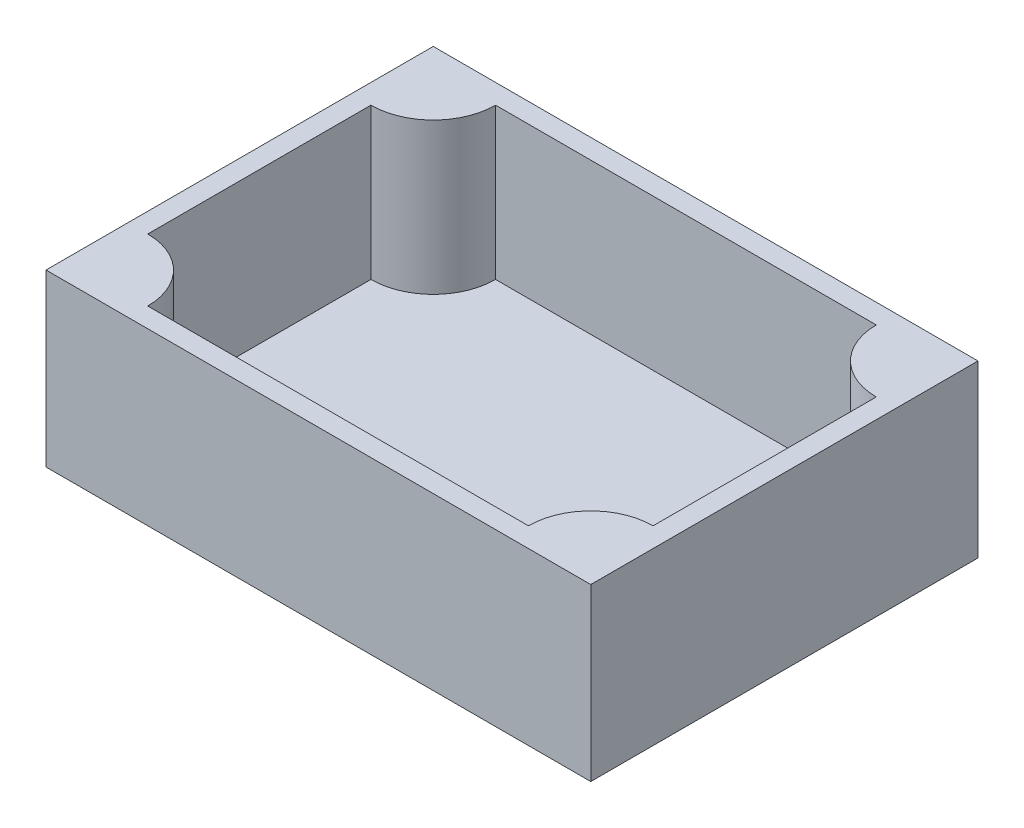
ISO-10303-21;
HEADER;
FILE_DESCRIPTION(('STEP AP214'),'2;1');
FILE_NAME('part.step','',(''),(''),'','','');
FILE_SCHEMA(('AUTOMOTIVE_DESIGN { 1 0 10303 214 1 1 1 1 }'));
ENDSEC;
DATA;
#1=APPLICATION_CONTEXT('core data for automotive mechanical design processes');
#2=APPLICATION_PROTOCOL_DEFINITION('international standard','automotive_design',2000,#1);
#3=PRODUCT_CONTEXT('',#1,'mechanical');
#4=PRODUCT('Part','Part','',(#3));
#5=PRODUCT_RELATED_PRODUCT_CATEGORY('part','',(#4));
#6=PRODUCT_DEFINITION_FORMATION('','',#4);
#7=PRODUCT_DEFINITION_CONTEXT('part definition',#1,'design');
#8=PRODUCT_DEFINITION('design','',#6,#7);
#9=PRODUCT_DEFINITION_SHAPE('','',#8);
#10=(LENGTH_UNIT() NAMED_UNIT(*) SI_UNIT(.MILLI.,.METRE.));
#11=(NAMED_UNIT(*) PLANE_ANGLE_UNIT() SI_UNIT($,.RADIAN.));
#12=(NAMED_UNIT(*) SI_UNIT($,.STERADIAN.) SOLID_ANGLE_UNIT());
#13=UNCERTAINTY_MEASURE_WITH_UNIT(LENGTH_MEASURE(1.E-05),#10,'distance_accuracy_value','');
#14=(GEOMETRIC_REPRESENTATION_CONTEXT(3) GLOBAL_UNCERTAINTY_ASSIGNED_CONTEXT((#13)) GLOBAL_UNIT_ASSIGNED_CONTEXT((#10,
#11,#12)) REPRESENTATION_CONTEXT('',''));
#15=CARTESIAN_POINT('',(0.,0.,0.));
#16=DIRECTION('',(0.,0.,1.));
#17=DIRECTION('',(1.,0.,0.));
#18=AXIS2_PLACEMENT_3D('',#15,#16,#17);
#19=CARTESIAN_POINT('',(0.,3.,0.));
#20=DIRECTION('',(1.,0.,0.));
#21=DIRECTION('',(0.,0.,-1.));
#22=AXIS2_PLACEMENT_3D('',#19,#20,#21);
#23=PLANE('',#22);
#24=DIRECTION('',(0.,0.,1.));
#25=VECTOR('',#24,1.);
#26=CARTESIAN_POINT('',(0.,0.,0.));
#27=LINE('',#26,#25);
#28=CARTESIAN_POINT('',(0.,0.,-59.));
#29=VERTEX_POINT('',#28);
#30=CARTESIAN_POINT('',(0.,0.,0.));
#31=VERTEX_POINT('',#30);
#32=EDGE_CURVE('E159',#29,#31,#27,.T.);
#33=ORIENTED_EDGE('',*,*,#32,.T.);
#34=DIRECTION('',(0.,-1.,0.));
#35=VECTOR('',#34,1.);
#36=CARTESIAN_POINT('',(0.,3.,0.));
#37=LINE('',#36,#35);
#38=CARTESIAN_POINT('',(0.,26.,0.));
#39=VERTEX_POINT('',#38);
#40=EDGE_CURVE('E12',#39,#31,#37,.T.);
#41=ORIENTED_EDGE('',*,*,#40,.F.);
#42=DIRECTION('',(0.,0.,-1.));
#43=VECTOR('',#42,1.);
#44=CARTESIAN_POINT('',(0.,26.,0.));
#45=LINE('',#44,#43);
#46=CARTESIAN_POINT('',(0.,26.,-59.));
#47=VERTEX_POINT('',#46);
#48=EDGE_CURVE('E147',#39,#47,#45,.T.);
#49=ORIENTED_EDGE('',*,*,#48,.T.);
#50=DIRECTION('',(0.,-1.,0.));
#51=VECTOR('',#50,1.);
#52=CARTESIAN_POINT('',(0.,3.,-59.));
#53=LINE('',#52,#51);
#54=EDGE_CURVE('E134',#47,#29,#53,.T.);
#55=ORIENTED_EDGE('',*,*,#54,.T.);
#56=EDGE_LOOP('',(#33,#41,#49,#55));
#57=FACE_BOUND('',#56,.T.);
#58=ADVANCED_FACE('F37',(#57),#23,.F.);
#59=CARTESIAN_POINT('',(0.,3.,0.));
#60=DIRECTION('',(0.,0.,-1.));
#61=DIRECTION('',(-1.,0.,0.));
#62=AXIS2_PLACEMENT_3D('',#59,#60,#61);
#63=PLANE('',#62);
#64=DIRECTION('',(1.,0.,0.));
#65=VECTOR('',#64,1.);
#66=CARTESIAN_POINT('',(0.,0.,0.));
#67=LINE('',#66,#65);
#68=CARTESIAN_POINT('',(83.,0.,0.));
#69=VERTEX_POINT('',#68);
#70=EDGE_CURVE('E172',#31,#69,#67,.T.);
#71=ORIENTED_EDGE('',*,*,#70,.T.);
#72=DIRECTION('',(0.,-1.,0.));
#73=VECTOR('',#72,1.);
#74=CARTESIAN_POINT('',(83.,3.,0.));
#75=LINE('',#74,#73);
#76=CARTESIAN_POINT('',(83.,26.,0.));
#77=VERTEX_POINT('',#76);
#78=EDGE_CURVE('E44',#77,#69,#75,.T.);
#79=ORIENTED_EDGE('',*,*,#78,.F.);
#80=DIRECTION('',(-1.,0.,0.));
#81=VECTOR('',#80,1.);
#82=CARTESIAN_POINT('',(83.,26.,0.));
#83=LINE('',#82,#81);
#84=EDGE_CURVE('E144',#77,#39,#83,.T.);
#85=ORIENTED_EDGE('',*,*,#84,.T.);
#86=ORIENTED_EDGE('',*,*,#40,.T.);
#87=EDGE_LOOP('',(#71,#79,#85,#86));
#88=FACE_BOUND('',#87,.T.);
#89=ADVANCED_FACE('F181',(#88),#63,.F.);
#90=CARTESIAN_POINT('',(83.,3.,0.));
#91=DIRECTION('',(-1.,0.,0.));
#92=DIRECTION('',(0.,0.,1.));
#93=AXIS2_PLACEMENT_3D('',#90,#91,#92);
#94=PLANE('',#93);
#95=DIRECTION('',(0.,0.,-1.));
#96=VECTOR('',#95,1.);
#97=CARTESIAN_POINT('',(83.,0.,0.));
#98=LINE('',#97,#96);
#99=CARTESIAN_POINT('',(83.,0.,-59.));
#100=VERTEX_POINT('',#99);
#101=EDGE_CURVE('E132',#69,#100,#98,.T.);
#102=ORIENTED_EDGE('',*,*,#101,.T.);
#103=DIRECTION('',(0.,-1.,0.));
#104=VECTOR('',#103,1.);
#105=CARTESIAN_POINT('',(83.,3.,-59.));
#106=LINE('',#105,#104);
#107=CARTESIAN_POINT('',(83.,26.,-59.));
#108=VERTEX_POINT('',#107);
#109=EDGE_CURVE('E126',#108,#100,#106,.T.);
#110=ORIENTED_EDGE('',*,*,#109,.F.);
#111=DIRECTION('',(0.,0.,1.));
#112=VECTOR('',#111,1.);
#113=CARTESIAN_POINT('',(83.,26.,0.));
#114=LINE('',#113,#112);
#115=EDGE_CURVE('E130',#108,#77,#114,.T.);
#116=ORIENTED_EDGE('',*,*,#115,.T.);
#117=ORIENTED_EDGE('',*,*,#78,.T.);
#118=EDGE_LOOP('',(#102,#110,#116,#117));
#119=FACE_BOUND('',#118,.T.);
#120=ADVANCED_FACE('F128',(#119),#94,.F.);
#121=CARTESIAN_POINT('',(0.,3.,-59.));
#122=DIRECTION('',(0.,0.,1.));
#123=DIRECTION('',(1.,0.,0.));
#124=AXIS2_PLACEMENT_3D('',#121,#122,#123);
#125=PLANE('',#124);
#126=DIRECTION('',(-1.,0.,0.));
#127=VECTOR('',#126,1.);
#128=CARTESIAN_POINT('',(0.,0.,-59.));
#129=LINE('',#128,#127);
#130=EDGE_CURVE('E59',#100,#29,#129,.T.);
#131=ORIENTED_EDGE('',*,*,#130,.T.);
#132=ORIENTED_EDGE('',*,*,#54,.F.);
#133=DIRECTION('',(1.,0.,0.));
#134=VECTOR('',#133,1.);
#135=CARTESIAN_POINT('',(83.,26.,-59.));
#136=LINE('',#135,#134);
#137=EDGE_CURVE('E141',#47,#108,#136,.T.);
#138=ORIENTED_EDGE('',*,*,#137,.T.);
#139=ORIENTED_EDGE('',*,*,#109,.T.);
#140=EDGE_LOOP('',(#131,#132,#138,#139));
#141=FACE_BOUND('',#140,.T.);
#142=ADVANCED_FACE('F146',(#141),#125,.F.);
#143=CARTESIAN_POINT('',(0.,0.,0.));
#144=DIRECTION('',(0.,-1.,0.));
#145=DIRECTION('',(0.,0.,-1.));
#146=AXIS2_PLACEMENT_3D('',#143,#144,#145);
#147=PLANE('',#146);
#148=ORIENTED_EDGE('',*,*,#32,.F.);
#149=ORIENTED_EDGE('',*,*,#130,.F.);
#150=ORIENTED_EDGE('',*,*,#101,.F.);
#151=ORIENTED_EDGE('',*,*,#70,.F.);
#152=EDGE_LOOP('',(#148,#149,#150,#151));
#153=FACE_BOUND('',#152,.T.);
#154=ADVANCED_FACE('F179',(#153),#147,.T.);
#155=CARTESIAN_POINT('',(3.00000000000001,153.833196944808,-3.));
#156=DIRECTION('',(0.,-1.,0.));
#157=DIRECTION('',(0.,0.,-1.));
#158=AXIS2_PLACEMENT_3D('',#155,#156,#157);
#159=CYLINDRICAL_SURFACE('',#158,9.49999999999998);
#160=CARTESIAN_POINT('',(3.00000000000001,26.,-3.));
#161=DIRECTION('',(0.,-1.,0.));
#162=DIRECTION('',(0.,0.,-1.));
#163=AXIS2_PLACEMENT_3D('',#160,#161,#162);
#164=CIRCLE('',#163,9.49999999999998);
#165=CARTESIAN_POINT('',(12.5,26.,-3.));
#166=VERTEX_POINT('',#165);
#167=CARTESIAN_POINT('',(3.00000000000001,26.,-12.5));
#168=VERTEX_POINT('',#167);
#169=EDGE_CURVE('E153',#166,#168,#164,.F.);
#170=ORIENTED_EDGE('',*,*,#169,.F.);
#171=DIRECTION('',(0.,-1.,0.));
#172=VECTOR('',#171,1.);
#173=CARTESIAN_POINT('',(12.5,153.833196944808,-3.));
#174=LINE('',#173,#172);
#175=CARTESIAN_POINT('',(12.5,3.,-3.));
#176=VERTEX_POINT('',#175);
#177=EDGE_CURVE('E149',#166,#176,#174,.T.);
#178=ORIENTED_EDGE('',*,*,#177,.T.);
#179=CARTESIAN_POINT('',(3.00000000000001,3.,-3.));
#180=DIRECTION('',(0.,-1.,0.));
#181=DIRECTION('',(0.,0.,-1.));
#182=AXIS2_PLACEMENT_3D('',#179,#180,#181);
#183=CIRCLE('',#182,9.49999999999998);
#184=CARTESIAN_POINT('',(3.00000000000001,3.,-12.5));
#185=VERTEX_POINT('',#184);
#186=EDGE_CURVE('E51',#185,#176,#183,.T.);
#187=ORIENTED_EDGE('',*,*,#186,.F.);
#188=DIRECTION('',(0.,-1.,0.));
#189=VECTOR('',#188,1.);
#190=CARTESIAN_POINT('',(3.00000000000001,153.833196944808,-12.5));
#191=LINE('',#190,#189);
#192=EDGE_CURVE('E156',#168,#185,#191,.T.);
#193=ORIENTED_EDGE('',*,*,#192,.F.);
#194=EDGE_LOOP('',(#170,#178,#187,#193));
#195=FACE_BOUND('',#194,.T.);
#196=ADVANCED_FACE('F228',(#195),#159,.T.);
#197=CARTESIAN_POINT('',(12.5,153.833196944808,-3.));
#198=DIRECTION('',(0.,0.,-1.));
#199=DIRECTION('',(-1.,0.,0.));
#200=AXIS2_PLACEMENT_3D('',#197,#198,#199);
#201=PLANE('',#200);
#202=DIRECTION('',(-1.,0.,0.));
#203=VECTOR('',#202,1.);
#204=CARTESIAN_POINT('',(12.5,26.,-3.));
#205=LINE('',#204,#203);
#206=CARTESIAN_POINT('',(70.5,26.,-3.));
#207=VERTEX_POINT('',#206);
#208=EDGE_CURVE('E157',#207,#166,#205,.T.);
#209=ORIENTED_EDGE('',*,*,#208,.F.);
#210=DIRECTION('',(0.,-1.,0.));
#211=VECTOR('',#210,1.);
#212=CARTESIAN_POINT('',(70.5,153.833196944808,-3.));
#213=LINE('',#212,#211);
#214=CARTESIAN_POINT('',(70.5,3.,-3.));
#215=VERTEX_POINT('',#214);
#216=EDGE_CURVE('E198',#207,#215,#213,.T.);
#217=ORIENTED_EDGE('',*,*,#216,.T.);
#218=DIRECTION('',(1.,0.,0.));
#219=VECTOR('',#218,1.);
#220=CARTESIAN_POINT('',(12.5,3.,-3.));
#221=LINE('',#220,#219);
#222=EDGE_CURVE('E203',#176,#215,#221,.T.);
#223=ORIENTED_EDGE('',*,*,#222,.F.);
#224=ORIENTED_EDGE('',*,*,#177,.F.);
#225=EDGE_LOOP('',(#209,#217,#223,#224));
#226=FACE_BOUND('',#225,.T.);
#227=ADVANCED_FACE('F234',(#226),#201,.T.);
#228=CARTESIAN_POINT('',(80.,153.833196944808,-3.00000000000001));
#229=DIRECTION('',(0.,-1.,0.));
#230=DIRECTION('',(0.,0.,-1.));
#231=AXIS2_PLACEMENT_3D('',#228,#229,#230);
#232=CYLINDRICAL_SURFACE('',#231,9.49999999999997);
#233=CARTESIAN_POINT('',(80.,26.,-3.00000000000001));
#234=DIRECTION('',(0.,-1.,0.));
#235=DIRECTION('',(0.,0.,-1.));
#236=AXIS2_PLACEMENT_3D('',#233,#234,#235);
#237=CIRCLE('',#236,9.49999999999997);
#238=CARTESIAN_POINT('',(80.,26.,-12.5));
#239=VERTEX_POINT('',#238);
#240=EDGE_CURVE('E160',#239,#207,#237,.F.);
#241=ORIENTED_EDGE('',*,*,#240,.F.);
#242=DIRECTION('',(0.,-1.,0.));
#243=VECTOR('',#242,1.);
#244=CARTESIAN_POINT('',(80.,153.833196944808,-12.5));
#245=LINE('',#244,#243);
#246=CARTESIAN_POINT('',(80.,3.,-12.5));
#247=VERTEX_POINT('',#246);
#248=EDGE_CURVE('E196',#239,#247,#245,.T.);
#249=ORIENTED_EDGE('',*,*,#248,.T.);
#250=CARTESIAN_POINT('',(80.,3.,-3.00000000000001));
#251=DIRECTION('',(0.,-1.,0.));
#252=DIRECTION('',(0.,0.,1.));
#253=AXIS2_PLACEMENT_3D('',#250,#251,#252);
#254=CIRCLE('',#253,9.49999999999997);
#255=EDGE_CURVE('E207',#215,#247,#254,.T.);
#256=ORIENTED_EDGE('',*,*,#255,.F.);
#257=ORIENTED_EDGE('',*,*,#216,.F.);
#258=EDGE_LOOP('',(#241,#249,#256,#257));
#259=FACE_BOUND('',#258,.T.);
#260=ADVANCED_FACE('F240',(#259),#232,.T.);
#261=CARTESIAN_POINT('',(80.,153.833196944808,-46.5));
#262=DIRECTION('',(-1.,0.,0.));
#263=DIRECTION('',(0.,0.,1.));
#264=AXIS2_PLACEMENT_3D('',#261,#262,#263);
#265=PLANE('',#264);
#266=DIRECTION('',(0.,0.,1.));
#267=VECTOR('',#266,1.);
#268=CARTESIAN_POINT('',(80.,26.,-46.5));
#269=LINE('',#268,#267);
#270=CARTESIAN_POINT('',(80.,26.,-46.5));
#271=VERTEX_POINT('',#270);
#272=EDGE_CURVE('E162',#271,#239,#269,.T.);
#273=ORIENTED_EDGE('',*,*,#272,.F.);
#274=DIRECTION('',(0.,-1.,0.));
#275=VECTOR('',#274,1.);
#276=CARTESIAN_POINT('',(80.,153.833196944808,-46.5));
#277=LINE('',#276,#275);
#278=CARTESIAN_POINT('',(80.,3.,-46.5));
#279=VERTEX_POINT('',#278);
#280=EDGE_CURVE('E194',#271,#279,#277,.T.);
#281=ORIENTED_EDGE('',*,*,#280,.T.);
#282=DIRECTION('',(0.,0.,-1.));
#283=VECTOR('',#282,1.);
#284=CARTESIAN_POINT('',(80.,3.,-46.5));
#285=LINE('',#284,#283);
#286=EDGE_CURVE('E210',#247,#279,#285,.T.);
#287=ORIENTED_EDGE('',*,*,#286,.F.);
#288=ORIENTED_EDGE('',*,*,#248,.F.);
#289=EDGE_LOOP('',(#273,#281,#287,#288));
#290=FACE_BOUND('',#289,.T.);
#291=ADVANCED_FACE('F244',(#290),#265,.T.);
#292=CARTESIAN_POINT('',(80.,153.833196944808,-56.));
#293=DIRECTION('',(0.,-1.,0.));
#294=DIRECTION('',(0.,0.,-1.));
#295=AXIS2_PLACEMENT_3D('',#292,#293,#294);
#296=CYLINDRICAL_SURFACE('',#295,9.49999999999997);
#297=CARTESIAN_POINT('',(80.,26.,-56.));
#298=DIRECTION('',(0.,-1.,0.));
#299=DIRECTION('',(0.,0.,-1.));
#300=AXIS2_PLACEMENT_3D('',#297,#298,#299);
#301=CIRCLE('',#300,9.49999999999997);
#302=CARTESIAN_POINT('',(70.5,26.,-56.));
#303=VERTEX_POINT('',#302);
#304=EDGE_CURVE('E164',#303,#271,#301,.F.);
#305=ORIENTED_EDGE('',*,*,#304,.F.);
#306=DIRECTION('',(0.,-1.,0.));
#307=VECTOR('',#306,1.);
#308=CARTESIAN_POINT('',(70.5,153.833196944808,-56.));
#309=LINE('',#308,#307);
#310=CARTESIAN_POINT('',(70.5,3.,-56.));
#311=VERTEX_POINT('',#310);
#312=EDGE_CURVE('E192',#303,#311,#309,.T.);
#313=ORIENTED_EDGE('',*,*,#312,.T.);
#314=CARTESIAN_POINT('',(80.,3.,-56.));
#315=DIRECTION('',(0.,-1.,0.));
#316=DIRECTION('',(0.,0.,-1.));
#317=AXIS2_PLACEMENT_3D('',#314,#315,#316);
#318=CIRCLE('',#317,9.49999999999997);
#319=EDGE_CURVE('E213',#279,#311,#318,.T.);
#320=ORIENTED_EDGE('',*,*,#319,.F.);
#321=ORIENTED_EDGE('',*,*,#280,.F.);
#322=EDGE_LOOP('',(#305,#313,#320,#321));
#323=FACE_BOUND('',#322,.T.);
#324=ADVANCED_FACE('F249',(#323),#296,.T.);
#325=CARTESIAN_POINT('',(12.5,153.833196944808,-56.));
#326=DIRECTION('',(0.,0.,1.));
#327=DIRECTION('',(1.,0.,0.));
#328=AXIS2_PLACEMENT_3D('',#325,#326,#327);
#329=PLANE('',#328);
#330=DIRECTION('',(1.,0.,0.));
#331=VECTOR('',#330,1.);
#332=CARTESIAN_POINT('',(12.5,26.,-56.));
#333=LINE('',#332,#331);
#334=CARTESIAN_POINT('',(12.5,26.,-56.));
#335=VERTEX_POINT('',#334);
#336=EDGE_CURVE('E166',#335,#303,#333,.T.);
#337=ORIENTED_EDGE('',*,*,#336,.F.);
#338=DIRECTION('',(0.,-1.,0.));
#339=VECTOR('',#338,1.);
#340=CARTESIAN_POINT('',(12.5,153.833196944808,-56.));
#341=LINE('',#340,#339);
#342=CARTESIAN_POINT('',(12.5,3.,-56.));
#343=VERTEX_POINT('',#342);
#344=EDGE_CURVE('E190',#335,#343,#341,.T.);
#345=ORIENTED_EDGE('',*,*,#344,.T.);
#346=DIRECTION('',(-1.,0.,0.));
#347=VECTOR('',#346,1.);
#348=CARTESIAN_POINT('',(12.5,3.,-56.));
#349=LINE('',#348,#347);
#350=EDGE_CURVE('E184',#311,#343,#349,.T.);
#351=ORIENTED_EDGE('',*,*,#350,.F.);
#352=ORIENTED_EDGE('',*,*,#312,.F.);
#353=EDGE_LOOP('',(#337,#345,#351,#352));
#354=FACE_BOUND('',#353,.T.);
#355=ADVANCED_FACE('F254',(#354),#329,.T.);
#356=CARTESIAN_POINT('',(3.00000000000001,153.833196944808,-56.));
#357=DIRECTION('',(0.,-1.,0.));
#358=DIRECTION('',(0.,0.,-1.));
#359=AXIS2_PLACEMENT_3D('',#356,#357,#358);
#360=CYLINDRICAL_SURFACE('',#359,9.49999999999998);
#361=CARTESIAN_POINT('',(3.00000000000001,26.,-56.));
#362=DIRECTION('',(0.,-1.,0.));
#363=DIRECTION('',(0.,0.,-1.));
#364=AXIS2_PLACEMENT_3D('',#361,#362,#363);
#365=CIRCLE('',#364,9.49999999999998);
#366=CARTESIAN_POINT('',(3.00000000000001,26.,-46.5));
#367=VERTEX_POINT('',#366);
#368=EDGE_CURVE('E168',#367,#335,#365,.F.);
#369=ORIENTED_EDGE('',*,*,#368,.F.);
#370=DIRECTION('',(0.,-1.,0.));
#371=VECTOR('',#370,1.);
#372=CARTESIAN_POINT('',(3.00000000000001,153.833196944808,-46.5));
#373=LINE('',#372,#371);
#374=CARTESIAN_POINT('',(3.00000000000001,3.,-46.5));
#375=VERTEX_POINT('',#374);
#376=EDGE_CURVE('E188',#367,#375,#373,.T.);
#377=ORIENTED_EDGE('',*,*,#376,.T.);
#378=CARTESIAN_POINT('',(3.00000000000001,3.,-56.));
#379=DIRECTION('',(0.,-1.,0.));
#380=DIRECTION('',(0.,0.,1.));
#381=AXIS2_PLACEMENT_3D('',#378,#379,#380);
#382=CIRCLE('',#381,9.49999999999998);
#383=EDGE_CURVE('E182',#343,#375,#382,.T.);
#384=ORIENTED_EDGE('',*,*,#383,.F.);
#385=ORIENTED_EDGE('',*,*,#344,.F.);
#386=EDGE_LOOP('',(#369,#377,#384,#385));
#387=FACE_BOUND('',#386,.T.);
#388=ADVANCED_FACE('F258',(#387),#360,.T.);
#389=CARTESIAN_POINT('',(3.00000000000001,153.833196944808,-46.5));
#390=DIRECTION('',(1.,0.,0.));
#391=DIRECTION('',(0.,0.,-1.));
#392=AXIS2_PLACEMENT_3D('',#389,#390,#391);
#393=PLANE('',#392);
#394=DIRECTION('',(0.,0.,-1.));
#395=VECTOR('',#394,1.);
#396=CARTESIAN_POINT('',(3.00000000000001,26.,-46.5));
#397=LINE('',#396,#395);
#398=EDGE_CURVE('E155',#168,#367,#397,.T.);
#399=ORIENTED_EDGE('',*,*,#398,.F.);
#400=ORIENTED_EDGE('',*,*,#192,.T.);
#401=DIRECTION('',(0.,0.,1.));
#402=VECTOR('',#401,1.);
#403=CARTESIAN_POINT('',(3.00000000000001,3.,-46.5));
#404=LINE('',#403,#402);
#405=EDGE_CURVE('E204',#375,#185,#404,.T.);
#406=ORIENTED_EDGE('',*,*,#405,.F.);
#407=ORIENTED_EDGE('',*,*,#376,.F.);
#408=EDGE_LOOP('',(#399,#400,#406,#407));
#409=FACE_BOUND('',#408,.T.);
#410=ADVANCED_FACE('F226',(#409),#393,.T.);
#411=CARTESIAN_POINT('',(0.,26.,0.));
#412=DIRECTION('',(0.,-1.,0.));
#413=DIRECTION('',(0.,0.,-1.));
#414=AXIS2_PLACEMENT_3D('',#411,#412,#413);
#415=PLANE('',#414);
#416=ORIENTED_EDGE('',*,*,#169,.T.);
#417=ORIENTED_EDGE('',*,*,#398,.T.);
#418=ORIENTED_EDGE('',*,*,#368,.T.);
#419=ORIENTED_EDGE('',*,*,#336,.T.);
#420=ORIENTED_EDGE('',*,*,#304,.T.);
#421=ORIENTED_EDGE('',*,*,#272,.T.);
#422=ORIENTED_EDGE('',*,*,#240,.T.);
#423=ORIENTED_EDGE('',*,*,#208,.T.);
#424=EDGE_LOOP('',(#416,#417,#418,#419,#420,#421,#422,#423));
#425=FACE_BOUND('',#424,.T.);
#426=ORIENTED_EDGE('',*,*,#115,.F.);
#427=ORIENTED_EDGE('',*,*,#137,.F.);
#428=ORIENTED_EDGE('',*,*,#48,.F.);
#429=ORIENTED_EDGE('',*,*,#84,.F.);
#430=EDGE_LOOP('',(#426,#427,#428,#429));
#431=FACE_BOUND('',#430,.T.);
#432=ADVANCED_FACE('F139',(#425,#431),#415,.F.);
#433=CARTESIAN_POINT('',(0.,3.,0.));
#434=DIRECTION('',(0.,-1.,0.));
#435=DIRECTION('',(0.,0.,-1.));
#436=AXIS2_PLACEMENT_3D('',#433,#434,#435);
#437=PLANE('',#436);
#438=ORIENTED_EDGE('',*,*,#405,.T.);
#439=ORIENTED_EDGE('',*,*,#186,.T.);
#440=ORIENTED_EDGE('',*,*,#222,.T.);
#441=ORIENTED_EDGE('',*,*,#255,.T.);
#442=ORIENTED_EDGE('',*,*,#286,.T.);
#443=ORIENTED_EDGE('',*,*,#319,.T.);
#444=ORIENTED_EDGE('',*,*,#350,.T.);
#445=ORIENTED_EDGE('',*,*,#383,.T.);
#446=EDGE_LOOP('',(#438,#439,#440,#441,#442,#443,#444,#445));
#447=FACE_BOUND('',#446,.T.);
#448=ADVANCED_FACE('F221',(#447),#437,.F.);
#449=CLOSED_SHELL('',(#58,#89,#120,#142,#154,#196,#227,#260,#291,#324,#355,#388,#410,#432,#448));
#450=MANIFOLD_SOLID_BREP('B2',#449);
#451=ADVANCED_BREP_SHAPE_REPRESENTATION('',(#18,#450),#14);
#452=SHAPE_DEFINITION_REPRESENTATION(#9,#451);
ENDSEC;
END-ISO-10303-21;
